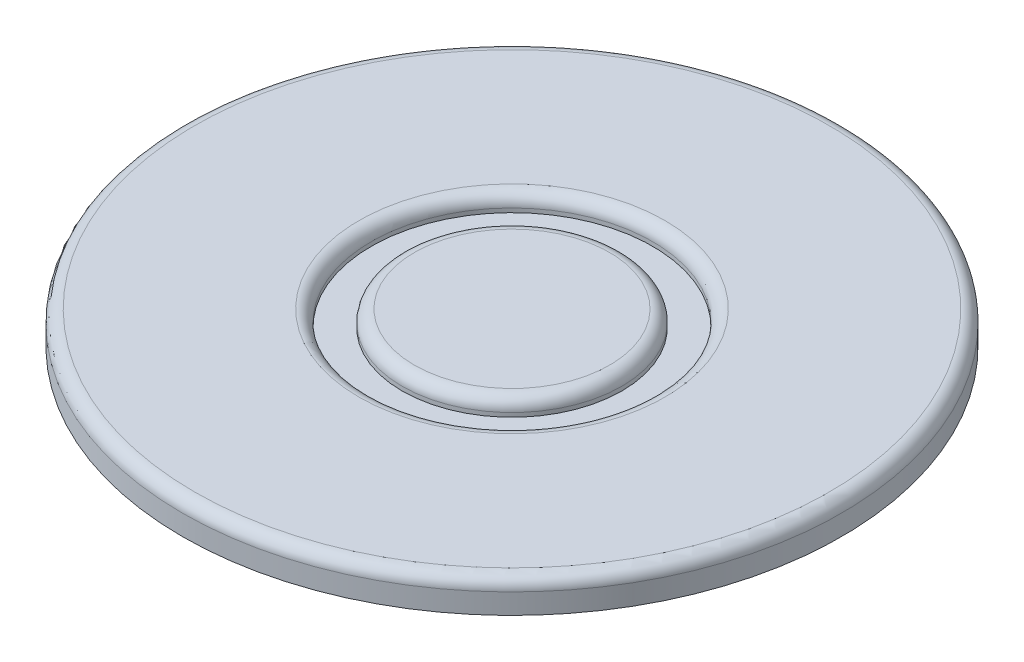
ISO-10303-21;
HEADER;
FILE_DESCRIPTION(('STEP AP214'),'2;1');
FILE_NAME('part.step','',(''),(''),'','','');
FILE_SCHEMA(('AUTOMOTIVE_DESIGN { 1 0 10303 214 1 1 1 1 }'));
ENDSEC;
DATA;
#1=APPLICATION_CONTEXT('core data for automotive mechanical design processes');
#2=APPLICATION_PROTOCOL_DEFINITION('international standard','automotive_design',2000,#1);
#3=PRODUCT_CONTEXT('',#1,'mechanical');
#4=PRODUCT('Part','Part','',(#3));
#5=PRODUCT_RELATED_PRODUCT_CATEGORY('part','',(#4));
#6=PRODUCT_DEFINITION_FORMATION('','',#4);
#7=PRODUCT_DEFINITION_CONTEXT('part definition',#1,'design');
#8=PRODUCT_DEFINITION('design','',#6,#7);
#9=PRODUCT_DEFINITION_SHAPE('','',#8);
#10=(LENGTH_UNIT() NAMED_UNIT(*) SI_UNIT(.MILLI.,.METRE.));
#11=(NAMED_UNIT(*) PLANE_ANGLE_UNIT() SI_UNIT($,.RADIAN.));
#12=(NAMED_UNIT(*) SI_UNIT($,.STERADIAN.) SOLID_ANGLE_UNIT());
#13=UNCERTAINTY_MEASURE_WITH_UNIT(LENGTH_MEASURE(1.E-05),#10,'distance_accuracy_value','');
#14=(GEOMETRIC_REPRESENTATION_CONTEXT(3) GLOBAL_UNCERTAINTY_ASSIGNED_CONTEXT((#13)) GLOBAL_UNIT_ASSIGNED_CONTEXT((#10,
#11,#12)) REPRESENTATION_CONTEXT('',''));
#15=CARTESIAN_POINT('',(0.,0.,0.));
#16=DIRECTION('',(0.,0.,1.));
#17=DIRECTION('',(1.,0.,0.));
#18=AXIS2_PLACEMENT_3D('',#15,#16,#17);
#19=CARTESIAN_POINT('',(0.,2.,0.));
#20=DIRECTION('',(0.,1.,0.));
#21=DIRECTION('',(0.,0.,1.));
#22=AXIS2_PLACEMENT_3D('',#19,#20,#21);
#23=PLANE('',#22);
#24=CARTESIAN_POINT('',(0.,2.,0.));
#25=DIRECTION('',(0.,1.,0.));
#26=DIRECTION('',(0.,0.,1.));
#27=AXIS2_PLACEMENT_3D('',#24,#25,#26);
#28=CIRCLE('',#27,39.);
#29=CARTESIAN_POINT('',(0.,2.,39.));
#30=VERTEX_POINT('',#29);
#31=EDGE_CURVE('E59',#30,#30,#28,.T.);
#32=ORIENTED_EDGE('',*,*,#31,.T.);
#33=EDGE_LOOP('',(#32));
#34=FACE_BOUND('',#33,.T.);
#35=CARTESIAN_POINT('',(0.,2.,0.));
#36=DIRECTION('',(0.,1.,0.));
#37=DIRECTION('',(0.,0.,1.));
#38=AXIS2_PLACEMENT_3D('',#35,#36,#37);
#39=CIRCLE('',#38,18.8);
#40=CARTESIAN_POINT('',(0.,2.,18.8));
#41=VERTEX_POINT('',#40);
#42=EDGE_CURVE('E62',#41,#41,#39,.F.);
#43=ORIENTED_EDGE('',*,*,#42,.T.);
#44=EDGE_LOOP('',(#43));
#45=FACE_BOUND('',#44,.T.);
#46=ADVANCED_FACE('F39',(#34,#45),#23,.T.);
#47=CARTESIAN_POINT('',(0.,2.,0.));
#48=DIRECTION('',(0.,-1.,0.));
#49=DIRECTION('',(0.,0.,-1.));
#50=AXIS2_PLACEMENT_3D('',#47,#48,#49);
#51=CYLINDRICAL_SURFACE('',#50,17.3);
#52=CARTESIAN_POINT('',(0.,0.5,0.));
#53=DIRECTION('',(0.,1.,0.));
#54=DIRECTION('',(0.,0.,1.));
#55=AXIS2_PLACEMENT_3D('',#52,#53,#54);
#56=CIRCLE('',#55,17.3);
#57=CARTESIAN_POINT('',(0.,0.5,17.3));
#58=VERTEX_POINT('',#57);
#59=EDGE_CURVE('E50',#58,#58,#56,.T.);
#60=ORIENTED_EDGE('',*,*,#59,.T.);
#61=EDGE_LOOP('',(#60));
#62=FACE_BOUND('',#61,.T.);
#63=CARTESIAN_POINT('',(0.,0.,0.));
#64=DIRECTION('',(0.,1.,0.));
#65=DIRECTION('',(0.,0.,1.));
#66=AXIS2_PLACEMENT_3D('',#63,#64,#65);
#67=CIRCLE('',#66,17.3);
#68=CARTESIAN_POINT('',(0.,0.,17.3));
#69=VERTEX_POINT('',#68);
#70=EDGE_CURVE('E69',#69,#69,#67,.T.);
#71=ORIENTED_EDGE('',*,*,#70,.F.);
#72=EDGE_LOOP('',(#71));
#73=FACE_BOUND('',#72,.T.);
#74=ADVANCED_FACE('F77',(#62,#73),#51,.F.);
#75=CARTESIAN_POINT('',(0.,0.,0.));
#76=DIRECTION('',(0.,-1.,0.));
#77=DIRECTION('',(0.,0.,-1.));
#78=AXIS2_PLACEMENT_3D('',#75,#76,#77);
#79=PLANE('',#78);
#80=CARTESIAN_POINT('',(0.,0.,0.));
#81=DIRECTION('',(0.,-1.,0.));
#82=DIRECTION('',(0.,0.,-1.));
#83=AXIS2_PLACEMENT_3D('',#80,#81,#82);
#84=CIRCLE('',#83,13.5);
#85=CARTESIAN_POINT('',(0.,0.,-13.5));
#86=VERTEX_POINT('',#85);
#87=EDGE_CURVE('E65',#86,#86,#84,.F.);
#88=ORIENTED_EDGE('',*,*,#87,.F.);
#89=EDGE_LOOP('',(#88));
#90=FACE_BOUND('',#89,.T.);
#91=ORIENTED_EDGE('',*,*,#70,.T.);
#92=EDGE_LOOP('',(#91));
#93=FACE_BOUND('',#92,.T.);
#94=ADVANCED_FACE('F75',(#90,#93),#79,.F.);
#95=CARTESIAN_POINT('',(0.,2.,0.));
#96=DIRECTION('',(0.,-1.,0.));
#97=DIRECTION('',(0.,0.,-1.));
#98=AXIS2_PLACEMENT_3D('',#95,#96,#97);
#99=CYLINDRICAL_SURFACE('',#98,13.5);
#100=CARTESIAN_POINT('',(0.,0.5,0.));
#101=DIRECTION('',(0.,1.,0.));
#102=DIRECTION('',(0.,0.,1.));
#103=AXIS2_PLACEMENT_3D('',#100,#101,#102);
#104=CIRCLE('',#103,13.5);
#105=CARTESIAN_POINT('',(0.,0.5,13.5));
#106=VERTEX_POINT('',#105);
#107=EDGE_CURVE('E11',#106,#106,#104,.F.);
#108=ORIENTED_EDGE('',*,*,#107,.T.);
#109=EDGE_LOOP('',(#108));
#110=FACE_BOUND('',#109,.T.);
#111=ORIENTED_EDGE('',*,*,#87,.T.);
#112=EDGE_LOOP('',(#111));
#113=FACE_BOUND('',#112,.T.);
#114=ADVANCED_FACE('F85',(#110,#113),#99,.T.);
#115=CARTESIAN_POINT('',(0.,2.,0.));
#116=DIRECTION('',(0.,1.,0.));
#117=DIRECTION('',(0.,0.,1.));
#118=AXIS2_PLACEMENT_3D('',#115,#116,#117);
#119=PLANE('',#118);
#120=CARTESIAN_POINT('',(0.,2.,0.));
#121=DIRECTION('',(0.,1.,0.));
#122=DIRECTION('',(0.,0.,1.));
#123=AXIS2_PLACEMENT_3D('',#120,#121,#122);
#124=CIRCLE('',#123,12.);
#125=CARTESIAN_POINT('',(0.,2.,12.));
#126=VERTEX_POINT('',#125);
#127=EDGE_CURVE('E46',#126,#126,#124,.T.);
#128=ORIENTED_EDGE('',*,*,#127,.T.);
#129=EDGE_LOOP('',(#128));
#130=FACE_BOUND('',#129,.T.);
#131=ADVANCED_FACE('F130',(#130),#119,.T.);
#132=CARTESIAN_POINT('',(0.,-8.,0.));
#133=DIRECTION('',(0.,1.,0.));
#134=DIRECTION('',(0.,0.,1.));
#135=AXIS2_PLACEMENT_3D('',#132,#133,#134);
#136=CYLINDRICAL_SURFACE('',#135,40.5);
#137=CARTESIAN_POINT('',(0.,0.5,0.));
#138=DIRECTION('',(0.,1.,0.));
#139=DIRECTION('',(0.,0.,1.));
#140=AXIS2_PLACEMENT_3D('',#137,#138,#139);
#141=CIRCLE('',#140,40.5);
#142=CARTESIAN_POINT('',(0.,0.5,40.5));
#143=VERTEX_POINT('',#142);
#144=EDGE_CURVE('E54',#143,#143,#141,.F.);
#145=ORIENTED_EDGE('',*,*,#144,.T.);
#146=EDGE_LOOP('',(#145));
#147=FACE_BOUND('',#146,.T.);
#148=CARTESIAN_POINT('',(0.,-2.,0.));
#149=DIRECTION('',(0.,-1.,0.));
#150=DIRECTION('',(0.,0.,-1.));
#151=AXIS2_PLACEMENT_3D('',#148,#149,#150);
#152=CIRCLE('',#151,40.5);
#153=CARTESIAN_POINT('',(0.,-2.,-40.5));
#154=VERTEX_POINT('',#153);
#155=EDGE_CURVE('E66',#154,#154,#152,.T.);
#156=ORIENTED_EDGE('',*,*,#155,.F.);
#157=EDGE_LOOP('',(#156));
#158=FACE_BOUND('',#157,.T.);
#159=ADVANCED_FACE('F126',(#147,#158),#136,.T.);
#160=CARTESIAN_POINT('',(0.,-2.,0.));
#161=DIRECTION('',(0.,-1.,0.));
#162=DIRECTION('',(0.,0.,-1.));
#163=AXIS2_PLACEMENT_3D('',#160,#161,#162);
#164=PLANE('',#163);
#165=ORIENTED_EDGE('',*,*,#155,.T.);
#166=EDGE_LOOP('',(#165));
#167=FACE_BOUND('',#166,.T.);
#168=ADVANCED_FACE('F94',(#167),#164,.T.);
#169=CARTESIAN_POINT('',(0.,0.5,0.));
#170=DIRECTION('',(0.,1.,0.));
#171=DIRECTION('',(0.,0.,1.));
#172=AXIS2_PLACEMENT_3D('',#169,#170,#171);
#173=TOROIDAL_SURFACE('',#172,39.,1.5);
#174=ORIENTED_EDGE('',*,*,#144,.F.);
#175=EDGE_LOOP('',(#174));
#176=FACE_BOUND('',#175,.T.);
#177=ORIENTED_EDGE('',*,*,#31,.F.);
#178=EDGE_LOOP('',(#177));
#179=FACE_BOUND('',#178,.T.);
#180=ADVANCED_FACE('F91',(#176,#179),#173,.T.);
#181=CARTESIAN_POINT('',(0.,0.5,0.));
#182=DIRECTION('',(0.,1.,0.));
#183=DIRECTION('',(0.,0.,1.));
#184=AXIS2_PLACEMENT_3D('',#181,#182,#183);
#185=TOROIDAL_SURFACE('',#184,18.8,1.5);
#186=ORIENTED_EDGE('',*,*,#42,.F.);
#187=EDGE_LOOP('',(#186));
#188=FACE_BOUND('',#187,.T.);
#189=ORIENTED_EDGE('',*,*,#59,.F.);
#190=EDGE_LOOP('',(#189));
#191=FACE_BOUND('',#190,.T.);
#192=ADVANCED_FACE('F93',(#188,#191),#185,.T.);
#193=CARTESIAN_POINT('',(0.,0.5,0.));
#194=DIRECTION('',(0.,1.,0.));
#195=DIRECTION('',(0.,0.,1.));
#196=AXIS2_PLACEMENT_3D('',#193,#194,#195);
#197=TOROIDAL_SURFACE('',#196,12.,1.5);
#198=ORIENTED_EDGE('',*,*,#107,.F.);
#199=EDGE_LOOP('',(#198));
#200=FACE_BOUND('',#199,.T.);
#201=ORIENTED_EDGE('',*,*,#127,.F.);
#202=EDGE_LOOP('',(#201));
#203=FACE_BOUND('',#202,.T.);
#204=ADVANCED_FACE('F41',(#200,#203),#197,.T.);
#205=CLOSED_SHELL('',(#46,#74,#94,#114,#131,#159,#168,#180,#192,#204));
#206=MANIFOLD_SOLID_BREP('B2',#205);
#207=ADVANCED_BREP_SHAPE_REPRESENTATION('',(#18,#206),#14);
#208=SHAPE_DEFINITION_REPRESENTATION(#9,#207);
ENDSEC;
END-ISO-10303-21;
